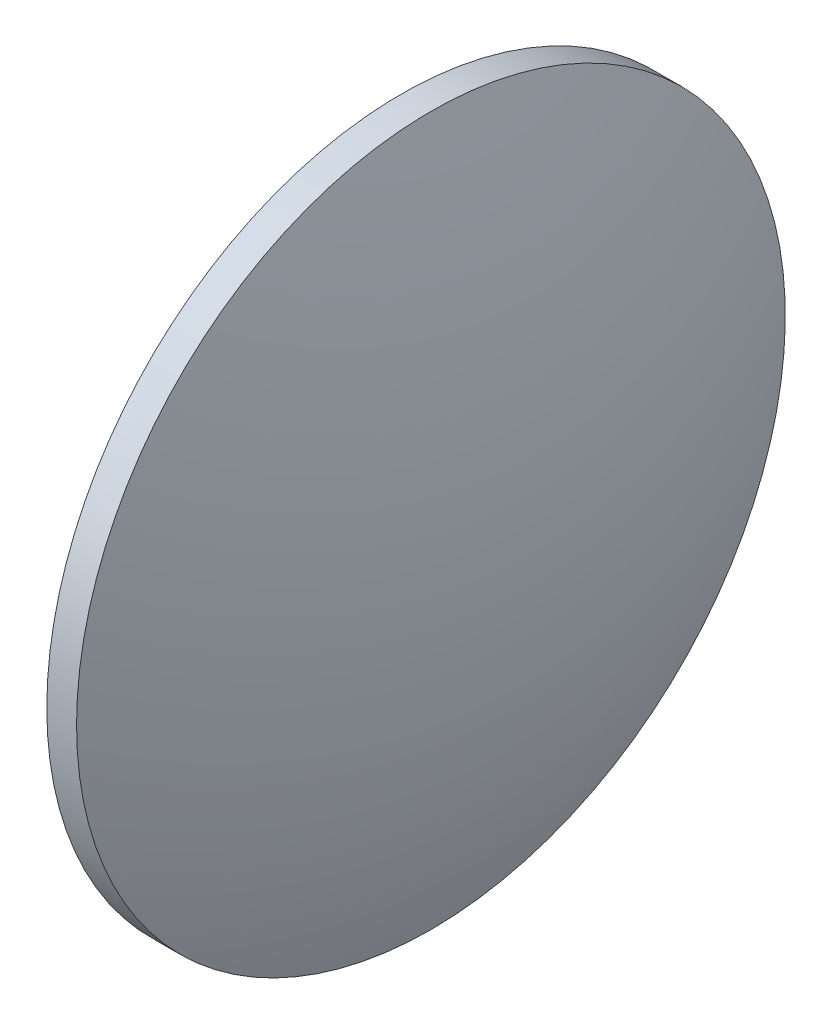
ISO-10303-21;
HEADER;
FILE_DESCRIPTION(('STEP AP214'),'2;1');
FILE_NAME('part.step','',(''),(''),'','','');
FILE_SCHEMA(('AUTOMOTIVE_DESIGN { 1 0 10303 214 1 1 1 1 }'));
ENDSEC;
DATA;
#1=APPLICATION_CONTEXT('core data for automotive mechanical design processes');
#2=APPLICATION_PROTOCOL_DEFINITION('international standard','automotive_design',2000,#1);
#3=PRODUCT_CONTEXT('',#1,'mechanical');
#4=PRODUCT('Part','Part','',(#3));
#5=PRODUCT_RELATED_PRODUCT_CATEGORY('part','',(#4));
#6=PRODUCT_DEFINITION_FORMATION('','',#4);
#7=PRODUCT_DEFINITION_CONTEXT('part definition',#1,'design');
#8=PRODUCT_DEFINITION('design','',#6,#7);
#9=PRODUCT_DEFINITION_SHAPE('','',#8);
#10=(LENGTH_UNIT() NAMED_UNIT(*) SI_UNIT(.MILLI.,.METRE.));
#11=(NAMED_UNIT(*) PLANE_ANGLE_UNIT() SI_UNIT($,.RADIAN.));
#12=(NAMED_UNIT(*) SI_UNIT($,.STERADIAN.) SOLID_ANGLE_UNIT());
#13=UNCERTAINTY_MEASURE_WITH_UNIT(LENGTH_MEASURE(1.E-05),#10,'distance_accuracy_value','');
#14=(GEOMETRIC_REPRESENTATION_CONTEXT(3) GLOBAL_UNCERTAINTY_ASSIGNED_CONTEXT((#13)) GLOBAL_UNIT_ASSIGNED_CONTEXT((#10,
#11,#12)) REPRESENTATION_CONTEXT('',''));
#15=CARTESIAN_POINT('',(0.,0.,0.));
#16=DIRECTION('',(0.,0.,1.));
#17=DIRECTION('',(1.,0.,0.));
#18=AXIS2_PLACEMENT_3D('',#15,#16,#17);
#19=CARTESIAN_POINT('',(57.1840788698799,65.0209453799623,0.));
#20=DIRECTION('',(-1.,0.,0.));
#21=DIRECTION('',(0.,-1.,0.));
#22=AXIS2_PLACEMENT_3D('',#19,#20,#21);
#23=SPHERICAL_SURFACE('',#22,62.229703087886);
#24=CARTESIAN_POINT('',(115.203781957766,65.0209453799623,0.));
#25=DIRECTION('',(-1.,0.,0.));
#26=DIRECTION('',(0.,0.,1.));
#27=AXIS2_PLACEMENT_3D('',#24,#25,#26);
#28=CIRCLE('',#27,22.5);
#29=CARTESIAN_POINT('',(115.203781957766,65.0209453799623,22.5));
#30=VERTEX_POINT('',#29);
#31=EDGE_CURVE('E10',#30,#30,#28,.T.);
#32=ORIENTED_EDGE('',*,*,#31,.F.);
#33=EDGE_LOOP('',(#32));
#34=FACE_BOUND('',#33,.T.);
#35=ADVANCED_FACE('F35',(#34),#23,.T.);
#36=CARTESIAN_POINT('',(108.665574330444,65.0209453799623,0.));
#37=DIRECTION('',(-1.,0.,0.));
#38=DIRECTION('',(0.,0.,1.));
#39=AXIS2_PLACEMENT_3D('',#36,#37,#38);
#40=CYLINDRICAL_SURFACE('',#39,22.5);
#41=CARTESIAN_POINT('',(113.313781957766,65.0209453799623,0.));
#42=DIRECTION('',(-1.,0.,0.));
#43=DIRECTION('',(0.,0.,1.));
#44=AXIS2_PLACEMENT_3D('',#41,#42,#43);
#45=CIRCLE('',#44,22.5);
#46=CARTESIAN_POINT('',(113.313781957766,65.0209453799623,22.5));
#47=VERTEX_POINT('',#46);
#48=EDGE_CURVE('E41',#47,#47,#45,.T.);
#49=ORIENTED_EDGE('',*,*,#48,.F.);
#50=EDGE_LOOP('',(#49));
#51=FACE_BOUND('',#50,.T.);
#52=ORIENTED_EDGE('',*,*,#31,.T.);
#53=EDGE_LOOP('',(#52));
#54=FACE_BOUND('',#53,.T.);
#55=ADVANCED_FACE('F49',(#51,#54),#40,.T.);
#56=CARTESIAN_POINT('',(113.313781957766,65.0209453799623,0.));
#57=DIRECTION('',(1.,0.,0.));
#58=DIRECTION('',(0.,0.,-1.));
#59=AXIS2_PLACEMENT_3D('',#56,#57,#58);
#60=PLANE('',#59);
#61=ORIENTED_EDGE('',*,*,#48,.T.);
#62=EDGE_LOOP('',(#61));
#63=FACE_BOUND('',#62,.T.);
#64=ADVANCED_FACE('F47',(#63),#60,.F.);
#65=CLOSED_SHELL('',(#35,#55,#64));
#66=MANIFOLD_SOLID_BREP('B2',#65);
#67=ADVANCED_BREP_SHAPE_REPRESENTATION('',(#18,#66),#14);
#68=SHAPE_DEFINITION_REPRESENTATION(#9,#67);
ENDSEC;
END-ISO-10303-21;
